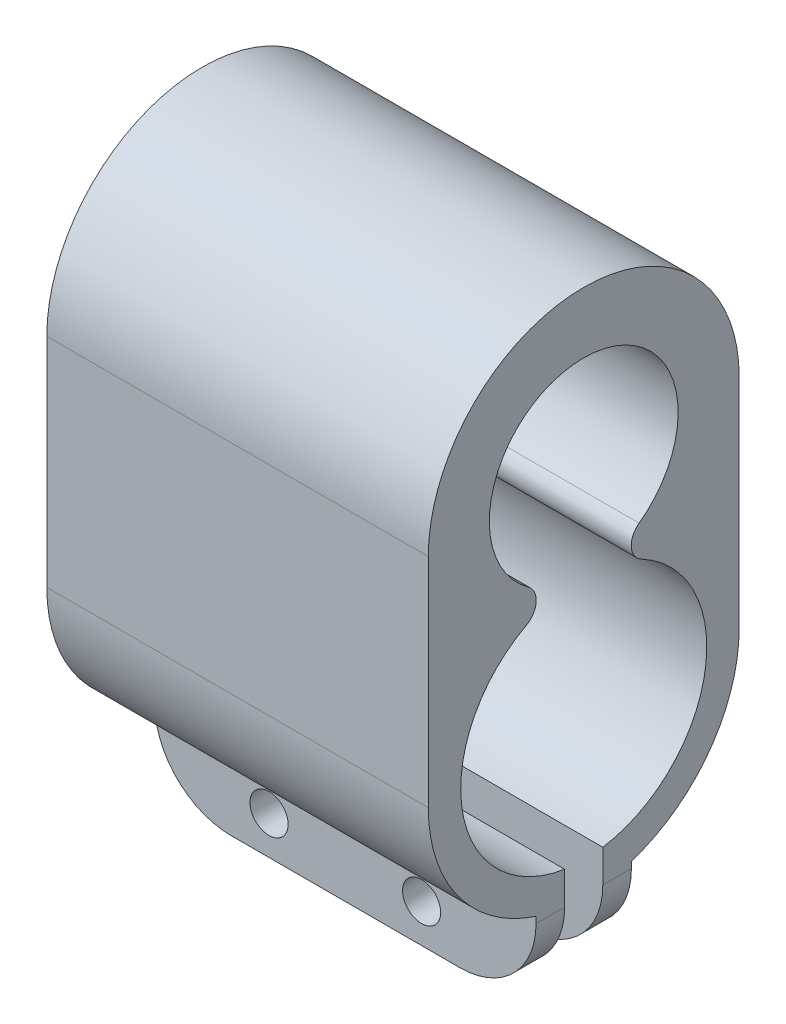
ISO-10303-21;
HEADER;
FILE_DESCRIPTION(('STEP AP214'),'2;1');
FILE_NAME('part.step','',(''),(''),'','','');
FILE_SCHEMA(('AUTOMOTIVE_DESIGN { 1 0 10303 214 1 1 1 1 }'));
ENDSEC;
DATA;
#1=APPLICATION_CONTEXT('core data for automotive mechanical design processes');
#2=APPLICATION_PROTOCOL_DEFINITION('international standard','automotive_design',2000,#1);
#3=PRODUCT_CONTEXT('',#1,'mechanical');
#4=PRODUCT('Part','Part','',(#3));
#5=PRODUCT_RELATED_PRODUCT_CATEGORY('part','',(#4));
#6=PRODUCT_DEFINITION_FORMATION('','',#4);
#7=PRODUCT_DEFINITION_CONTEXT('part definition',#1,'design');
#8=PRODUCT_DEFINITION('design','',#6,#7);
#9=PRODUCT_DEFINITION_SHAPE('','',#8);
#10=(LENGTH_UNIT() NAMED_UNIT(*) SI_UNIT(.MILLI.,.METRE.));
#11=(NAMED_UNIT(*) PLANE_ANGLE_UNIT() SI_UNIT($,.RADIAN.));
#12=(NAMED_UNIT(*) SI_UNIT($,.STERADIAN.) SOLID_ANGLE_UNIT());
#13=UNCERTAINTY_MEASURE_WITH_UNIT(LENGTH_MEASURE(1.E-05),#10,'distance_accuracy_value','');
#14=(GEOMETRIC_REPRESENTATION_CONTEXT(3) GLOBAL_UNCERTAINTY_ASSIGNED_CONTEXT((#13)) GLOBAL_UNIT_ASSIGNED_CONTEXT((#10,
#11,#12)) REPRESENTATION_CONTEXT('',''));
#15=CARTESIAN_POINT('',(0.,0.,0.));
#16=DIRECTION('',(0.,0.,1.));
#17=DIRECTION('',(1.,0.,0.));
#18=AXIS2_PLACEMENT_3D('',#15,#16,#17);
#19=CARTESIAN_POINT('',(20.,0.,0.));
#20=DIRECTION('',(-1.,0.,0.));
#21=DIRECTION('',(0.,0.,1.));
#22=AXIS2_PLACEMENT_3D('',#19,#20,#21);
#23=CYLINDRICAL_SURFACE('',#22,8.15);
#24=CARTESIAN_POINT('',(0.,0.,0.));
#25=DIRECTION('',(1.,0.,0.));
#26=DIRECTION('',(0.,0.,-1.));
#27=AXIS2_PLACEMENT_3D('',#24,#25,#26);
#28=CIRCLE('',#27,8.15);
#29=CARTESIAN_POINT('',(0.,0.,8.15));
#30=VERTEX_POINT('',#29);
#31=CARTESIAN_POINT('',(0.,-7.75709352786209,2.5));
#32=VERTEX_POINT('',#31);
#33=EDGE_CURVE('E184',#30,#32,#28,.T.);
#34=ORIENTED_EDGE('',*,*,#33,.T.);
#35=DIRECTION('',(-1.,0.,0.));
#36=VECTOR('',#35,1.);
#37=CARTESIAN_POINT('',(20.,-7.75709352786209,2.5));
#38=LINE('',#37,#36);
#39=CARTESIAN_POINT('',(20.,-7.75709352786209,2.5));
#40=VERTEX_POINT('',#39);
#41=EDGE_CURVE('E215',#32,#40,#38,.F.);
#42=ORIENTED_EDGE('',*,*,#41,.T.);
#43=CARTESIAN_POINT('',(20.,0.,0.));
#44=DIRECTION('',(1.,0.,0.));
#45=DIRECTION('',(0.,0.,-1.));
#46=AXIS2_PLACEMENT_3D('',#43,#44,#45);
#47=CIRCLE('',#46,8.15);
#48=CARTESIAN_POINT('',(20.,0.,8.15));
#49=VERTEX_POINT('',#48);
#50=EDGE_CURVE('E272',#49,#40,#47,.T.);
#51=ORIENTED_EDGE('',*,*,#50,.F.);
#52=DIRECTION('',(-1.,0.,0.));
#53=VECTOR('',#52,1.);
#54=CARTESIAN_POINT('',(20.,0.,8.15));
#55=LINE('',#54,#53);
#56=EDGE_CURVE('E287',#49,#30,#55,.T.);
#57=ORIENTED_EDGE('',*,*,#56,.T.);
#58=EDGE_LOOP('',(#34,#42,#51,#57));
#59=FACE_BOUND('',#58,.T.);
#60=ADVANCED_FACE('F33',(#59),#23,.T.);
#61=CARTESIAN_POINT('',(20.,0.,0.));
#62=DIRECTION('',(-1.,0.,0.));
#63=DIRECTION('',(0.,0.,1.));
#64=AXIS2_PLACEMENT_3D('',#61,#62,#63);
#65=CYLINDRICAL_SURFACE('',#64,6.45);
#66=DIRECTION('',(-1.,0.,0.));
#67=VECTOR('',#66,1.);
#68=CARTESIAN_POINT('',(20.,-6.37200910231616,1.));
#69=LINE('',#68,#67);
#70=CARTESIAN_POINT('',(0.,-6.37200910231616,1.));
#71=VERTEX_POINT('',#70);
#72=CARTESIAN_POINT('',(20.,-6.37200910231616,1.));
#73=VERTEX_POINT('',#72);
#74=EDGE_CURVE('E193',#71,#73,#69,.F.);
#75=ORIENTED_EDGE('',*,*,#74,.F.);
#76=CARTESIAN_POINT('',(0.,0.,0.));
#77=DIRECTION('',(1.,0.,0.));
#78=DIRECTION('',(0.,0.,-1.));
#79=AXIS2_PLACEMENT_3D('',#76,#77,#78);
#80=CIRCLE('',#79,6.45);
#81=CARTESIAN_POINT('',(0.,5.69814553161427,3.02219084449415));
#82=VERTEX_POINT('',#81);
#83=EDGE_CURVE('E236',#82,#71,#80,.T.);
#84=ORIENTED_EDGE('',*,*,#83,.F.);
#85=DIRECTION('',(-1.,0.,0.));
#86=VECTOR('',#85,1.);
#87=CARTESIAN_POINT('',(20.,5.69814553161427,3.02219084449415));
#88=LINE('',#87,#86);
#89=CARTESIAN_POINT('',(20.,5.69814553161427,3.02219084449416));
#90=VERTEX_POINT('',#89);
#91=EDGE_CURVE('E259',#90,#82,#88,.T.);
#92=ORIENTED_EDGE('',*,*,#91,.F.);
#93=CARTESIAN_POINT('',(20.,0.,0.));
#94=DIRECTION('',(1.,0.,0.));
#95=DIRECTION('',(0.,0.,-1.));
#96=AXIS2_PLACEMENT_3D('',#93,#94,#95);
#97=CIRCLE('',#96,6.45);
#98=EDGE_CURVE('E242',#90,#73,#97,.T.);
#99=ORIENTED_EDGE('',*,*,#98,.T.);
#100=EDGE_LOOP('',(#75,#84,#92,#99));
#101=FACE_BOUND('',#100,.T.);
#102=ADVANCED_FACE('F360',(#101),#65,.F.);
#103=CARTESIAN_POINT('',(20.,11.4,0.));
#104=DIRECTION('',(1.,0.,0.));
#105=DIRECTION('',(0.,0.,-1.));
#106=AXIS2_PLACEMENT_3D('',#103,#104,#105);
#107=PLANE('',#106);
#108=DIRECTION('',(0.,-1.,0.));
#109=VECTOR('',#108,1.);
#110=CARTESIAN_POINT('',(20.,-6.37200910231616,2.5));
#111=LINE('',#110,#109);
#112=CARTESIAN_POINT('',(20.,-8.08841764500326,2.5));
#113=VERTEX_POINT('',#112);
#114=EDGE_CURVE('E198',#40,#113,#111,.T.);
#115=ORIENTED_EDGE('',*,*,#114,.T.);
#116=DIRECTION('',(0.,0.,-1.));
#117=VECTOR('',#116,1.);
#118=CARTESIAN_POINT('',(20.,-8.08841764500326,0.));
#119=LINE('',#118,#117);
#120=CARTESIAN_POINT('',(20.,-8.08841764500326,1.));
#121=VERTEX_POINT('',#120);
#122=EDGE_CURVE('E11',#113,#121,#119,.T.);
#123=ORIENTED_EDGE('',*,*,#122,.T.);
#124=DIRECTION('',(0.,-1.,0.));
#125=VECTOR('',#124,1.);
#126=CARTESIAN_POINT('',(20.,-2.74249735562648,1.));
#127=LINE('',#126,#125);
#128=EDGE_CURVE('E223',#73,#121,#127,.T.);
#129=ORIENTED_EDGE('',*,*,#128,.F.);
#130=ORIENTED_EDGE('',*,*,#98,.F.);
#131=CARTESIAN_POINT('',(20.,6.58157894736842,3.49074756457077));
#132=DIRECTION('',(-1.,0.,0.));
#133=DIRECTION('',(0.,0.,-1.));
#134=AXIS2_PLACEMENT_3D('',#131,#132,#133);
#135=CIRCLE('',#134,0.999999999999998);
#136=CARTESIAN_POINT('',(20.,7.39139761167625,2.9040673016177));
#137=VERTEX_POINT('',#136);
#138=EDGE_CURVE('E238',#137,#90,#135,.T.);
#139=ORIENTED_EDGE('',*,*,#138,.F.);
#140=CARTESIAN_POINT('',(20.,11.4,0.));
#141=DIRECTION('',(1.,0.,0.));
#142=DIRECTION('',(0.,0.,-1.));
#143=AXIS2_PLACEMENT_3D('',#140,#141,#142);
#144=CIRCLE('',#143,4.95);
#145=CARTESIAN_POINT('',(20.,7.39139761167625,-2.9040673016177));
#146=VERTEX_POINT('',#145);
#147=EDGE_CURVE('E235',#146,#137,#144,.T.);
#148=ORIENTED_EDGE('',*,*,#147,.F.);
#149=CARTESIAN_POINT('',(20.,6.58157894736842,-3.49074756457077));
#150=DIRECTION('',(-1.,0.,0.));
#151=DIRECTION('',(0.,0.,-1.));
#152=AXIS2_PLACEMENT_3D('',#149,#150,#151);
#153=CIRCLE('',#152,0.999999999999999);
#154=CARTESIAN_POINT('',(20.,5.69814553161427,-3.02219084449416));
#155=VERTEX_POINT('',#154);
#156=EDGE_CURVE('E233',#155,#146,#153,.T.);
#157=ORIENTED_EDGE('',*,*,#156,.F.);
#158=CARTESIAN_POINT('',(20.,-6.37200910231616,-1.));
#159=VERTEX_POINT('',#158);
#160=EDGE_CURVE('E241',#159,#155,#97,.T.);
#161=ORIENTED_EDGE('',*,*,#160,.F.);
#162=DIRECTION('',(0.,1.,0.));
#163=VECTOR('',#162,1.);
#164=CARTESIAN_POINT('',(20.,-2.74249735562648,-1.));
#165=LINE('',#164,#163);
#166=CARTESIAN_POINT('',(20.,-8.08841764500326,-1.));
#167=VERTEX_POINT('',#166);
#168=EDGE_CURVE('E227',#167,#159,#165,.T.);
#169=ORIENTED_EDGE('',*,*,#168,.F.);
#170=DIRECTION('',(0.,0.,-1.));
#171=VECTOR('',#170,1.);
#172=CARTESIAN_POINT('',(20.,-8.08841764500326,0.));
#173=LINE('',#172,#171);
#174=CARTESIAN_POINT('',(20.,-8.08841764500326,-2.5));
#175=VERTEX_POINT('',#174);
#176=EDGE_CURVE('E41',#167,#175,#173,.T.);
#177=ORIENTED_EDGE('',*,*,#176,.T.);
#178=DIRECTION('',(0.,1.,0.));
#179=VECTOR('',#178,1.);
#180=CARTESIAN_POINT('',(20.,-6.37200910231616,-2.5));
#181=LINE('',#180,#179);
#182=CARTESIAN_POINT('',(20.,-7.75709352786209,-2.5));
#183=VERTEX_POINT('',#182);
#184=EDGE_CURVE('E210',#175,#183,#181,.T.);
#185=ORIENTED_EDGE('',*,*,#184,.T.);
#186=CARTESIAN_POINT('',(20.,0.,-8.15));
#187=VERTEX_POINT('',#186);
#188=EDGE_CURVE('E191',#183,#187,#47,.T.);
#189=ORIENTED_EDGE('',*,*,#188,.T.);
#190=DIRECTION('',(0.,1.,0.));
#191=VECTOR('',#190,1.);
#192=CARTESIAN_POINT('',(20.,11.4,-8.15));
#193=LINE('',#192,#191);
#194=CARTESIAN_POINT('',(20.,11.4,-8.15));
#195=VERTEX_POINT('',#194);
#196=EDGE_CURVE('E275',#187,#195,#193,.T.);
#197=ORIENTED_EDGE('',*,*,#196,.T.);
#198=CARTESIAN_POINT('',(20.,11.4,0.));
#199=DIRECTION('',(1.,0.,0.));
#200=DIRECTION('',(0.,0.,-1.));
#201=AXIS2_PLACEMENT_3D('',#198,#199,#200);
#202=CIRCLE('',#201,8.15);
#203=CARTESIAN_POINT('',(20.,11.4,8.15));
#204=VERTEX_POINT('',#203);
#205=EDGE_CURVE('E267',#195,#204,#202,.T.);
#206=ORIENTED_EDGE('',*,*,#205,.T.);
#207=DIRECTION('',(0.,-1.,0.));
#208=VECTOR('',#207,1.);
#209=CARTESIAN_POINT('',(20.,11.4,8.15));
#210=LINE('',#209,#208);
#211=EDGE_CURVE('E270',#204,#49,#210,.T.);
#212=ORIENTED_EDGE('',*,*,#211,.T.);
#213=ORIENTED_EDGE('',*,*,#50,.T.);
#214=EDGE_LOOP('',(#115,#123,#129,#130,#139,#148,#157,#161,#169,#177,#185,#189,#197,#206,#212,#213));
#215=FACE_BOUND('',#214,.T.);
#216=ADVANCED_FACE('F324',(#215),#107,.T.);
#217=CARTESIAN_POINT('',(0.,11.4,0.));
#218=DIRECTION('',(1.,0.,0.));
#219=DIRECTION('',(0.,0.,-1.));
#220=AXIS2_PLACEMENT_3D('',#217,#218,#219);
#221=PLANE('',#220);
#222=DIRECTION('',(0.,-1.,0.));
#223=VECTOR('',#222,1.);
#224=CARTESIAN_POINT('',(0.,-2.74249735562648,1.));
#225=LINE('',#224,#223);
#226=CARTESIAN_POINT('',(0.,-8.08841764500326,1.));
#227=VERTEX_POINT('',#226);
#228=EDGE_CURVE('E224',#71,#227,#225,.T.);
#229=ORIENTED_EDGE('',*,*,#228,.T.);
#230=DIRECTION('',(0.,0.,1.));
#231=VECTOR('',#230,1.);
#232=CARTESIAN_POINT('',(0.,-8.08841764500326,2.5));
#233=LINE('',#232,#231);
#234=CARTESIAN_POINT('',(0.,-8.08841764500326,2.5));
#235=VERTEX_POINT('',#234);
#236=EDGE_CURVE('E298',#227,#235,#233,.T.);
#237=ORIENTED_EDGE('',*,*,#236,.T.);
#238=DIRECTION('',(0.,1.,0.));
#239=VECTOR('',#238,1.);
#240=CARTESIAN_POINT('',(0.,-6.37200910231616,2.5));
#241=LINE('',#240,#239);
#242=EDGE_CURVE('E214',#235,#32,#241,.T.);
#243=ORIENTED_EDGE('',*,*,#242,.T.);
#244=ORIENTED_EDGE('',*,*,#33,.F.);
#245=DIRECTION('',(0.,-1.,0.));
#246=VECTOR('',#245,1.);
#247=CARTESIAN_POINT('',(0.,11.4,8.15));
#248=LINE('',#247,#246);
#249=CARTESIAN_POINT('',(0.,11.4,8.15));
#250=VERTEX_POINT('',#249);
#251=EDGE_CURVE('E185',#250,#30,#248,.T.);
#252=ORIENTED_EDGE('',*,*,#251,.F.);
#253=CARTESIAN_POINT('',(0.,11.4,0.));
#254=DIRECTION('',(1.,0.,0.));
#255=DIRECTION('',(0.,0.,-1.));
#256=AXIS2_PLACEMENT_3D('',#253,#254,#255);
#257=CIRCLE('',#256,8.15);
#258=CARTESIAN_POINT('',(0.,11.4,-8.15));
#259=VERTEX_POINT('',#258);
#260=EDGE_CURVE('E266',#259,#250,#257,.T.);
#261=ORIENTED_EDGE('',*,*,#260,.F.);
#262=DIRECTION('',(0.,1.,0.));
#263=VECTOR('',#262,1.);
#264=CARTESIAN_POINT('',(0.,11.4,-8.15));
#265=LINE('',#264,#263);
#266=CARTESIAN_POINT('',(0.,0.,-8.15));
#267=VERTEX_POINT('',#266);
#268=EDGE_CURVE('E180',#267,#259,#265,.T.);
#269=ORIENTED_EDGE('',*,*,#268,.F.);
#270=CARTESIAN_POINT('',(0.,-7.75709352786209,-2.5));
#271=VERTEX_POINT('',#270);
#272=EDGE_CURVE('E171',#271,#267,#28,.T.);
#273=ORIENTED_EDGE('',*,*,#272,.F.);
#274=DIRECTION('',(0.,-1.,0.));
#275=VECTOR('',#274,1.);
#276=CARTESIAN_POINT('',(0.,-6.37200910231616,-2.5));
#277=LINE('',#276,#275);
#278=CARTESIAN_POINT('',(0.,-8.08841764500326,-2.5));
#279=VERTEX_POINT('',#278);
#280=EDGE_CURVE('E177',#271,#279,#277,.T.);
#281=ORIENTED_EDGE('',*,*,#280,.T.);
#282=DIRECTION('',(0.,0.,1.));
#283=VECTOR('',#282,1.);
#284=CARTESIAN_POINT('',(0.,-8.08841764500326,-1.));
#285=LINE('',#284,#283);
#286=CARTESIAN_POINT('',(0.,-8.08841764500326,-1.));
#287=VERTEX_POINT('',#286);
#288=EDGE_CURVE('E192',#279,#287,#285,.T.);
#289=ORIENTED_EDGE('',*,*,#288,.T.);
#290=DIRECTION('',(0.,1.,0.));
#291=VECTOR('',#290,1.);
#292=CARTESIAN_POINT('',(0.,-2.74249735562648,-1.));
#293=LINE('',#292,#291);
#294=CARTESIAN_POINT('',(0.,-6.37200910231616,-1.));
#295=VERTEX_POINT('',#294);
#296=EDGE_CURVE('E226',#287,#295,#293,.T.);
#297=ORIENTED_EDGE('',*,*,#296,.T.);
#298=CARTESIAN_POINT('',(0.,5.69814553161427,-3.02219084449416));
#299=VERTEX_POINT('',#298);
#300=EDGE_CURVE('E254',#295,#299,#80,.T.);
#301=ORIENTED_EDGE('',*,*,#300,.T.);
#302=CARTESIAN_POINT('',(0.,6.58157894736842,-3.49074756457077));
#303=DIRECTION('',(-1.,0.,0.));
#304=DIRECTION('',(0.,0.,-1.));
#305=AXIS2_PLACEMENT_3D('',#302,#303,#304);
#306=CIRCLE('',#305,0.999999999999999);
#307=CARTESIAN_POINT('',(0.,7.39139761167625,-2.9040673016177));
#308=VERTEX_POINT('',#307);
#309=EDGE_CURVE('E229',#299,#308,#306,.T.);
#310=ORIENTED_EDGE('',*,*,#309,.T.);
#311=CARTESIAN_POINT('',(0.,11.4,0.));
#312=DIRECTION('',(1.,0.,0.));
#313=DIRECTION('',(0.,0.,-1.));
#314=AXIS2_PLACEMENT_3D('',#311,#312,#313);
#315=CIRCLE('',#314,4.95);
#316=CARTESIAN_POINT('',(0.,7.39139761167625,2.9040673016177));
#317=VERTEX_POINT('',#316);
#318=EDGE_CURVE('E248',#308,#317,#315,.T.);
#319=ORIENTED_EDGE('',*,*,#318,.T.);
#320=CARTESIAN_POINT('',(0.,6.58157894736842,3.49074756457077));
#321=DIRECTION('',(-1.,0.,0.));
#322=DIRECTION('',(0.,0.,-1.));
#323=AXIS2_PLACEMENT_3D('',#320,#321,#322);
#324=CIRCLE('',#323,0.999999999999998);
#325=EDGE_CURVE('E251',#317,#82,#324,.T.);
#326=ORIENTED_EDGE('',*,*,#325,.T.);
#327=ORIENTED_EDGE('',*,*,#83,.T.);
#328=EDGE_LOOP('',(#229,#237,#243,#244,#252,#261,#269,#273,#281,#289,#297,#301,#310,#319,#326,#327));
#329=FACE_BOUND('',#328,.T.);
#330=ADVANCED_FACE('F174',(#329),#221,.F.);
#331=CARTESIAN_POINT('',(20.,11.4,0.));
#332=DIRECTION('',(-1.,0.,0.));
#333=DIRECTION('',(0.,0.,1.));
#334=AXIS2_PLACEMENT_3D('',#331,#332,#333);
#335=CYLINDRICAL_SURFACE('',#334,8.15);
#336=ORIENTED_EDGE('',*,*,#260,.T.);
#337=DIRECTION('',(-1.,0.,0.));
#338=VECTOR('',#337,1.);
#339=CARTESIAN_POINT('',(20.,11.4,8.15));
#340=LINE('',#339,#338);
#341=EDGE_CURVE('E290',#204,#250,#340,.T.);
#342=ORIENTED_EDGE('',*,*,#341,.F.);
#343=ORIENTED_EDGE('',*,*,#205,.F.);
#344=DIRECTION('',(-1.,0.,0.));
#345=VECTOR('',#344,1.);
#346=CARTESIAN_POINT('',(20.,11.4,-8.15));
#347=LINE('',#346,#345);
#348=EDGE_CURVE('E277',#195,#259,#347,.T.);
#349=ORIENTED_EDGE('',*,*,#348,.T.);
#350=EDGE_LOOP('',(#336,#342,#343,#349));
#351=FACE_BOUND('',#350,.T.);
#352=ADVANCED_FACE('F390',(#351),#335,.T.);
#353=CARTESIAN_POINT('',(20.,11.4,8.15));
#354=DIRECTION('',(0.,0.,-1.));
#355=DIRECTION('',(0.,1.,0.));
#356=AXIS2_PLACEMENT_3D('',#353,#354,#355);
#357=PLANE('',#356);
#358=ORIENTED_EDGE('',*,*,#251,.T.);
#359=ORIENTED_EDGE('',*,*,#56,.F.);
#360=ORIENTED_EDGE('',*,*,#211,.F.);
#361=ORIENTED_EDGE('',*,*,#341,.T.);
#362=EDGE_LOOP('',(#358,#359,#360,#361));
#363=FACE_BOUND('',#362,.T.);
#364=ADVANCED_FACE('F388',(#363),#357,.F.);
#365=ORIENTED_EDGE('',*,*,#188,.F.);
#366=DIRECTION('',(-1.,0.,0.));
#367=VECTOR('',#366,1.);
#368=CARTESIAN_POINT('',(20.,-7.75709352786209,-2.5));
#369=LINE('',#368,#367);
#370=EDGE_CURVE('E189',#183,#271,#369,.T.);
#371=ORIENTED_EDGE('',*,*,#370,.T.);
#372=ORIENTED_EDGE('',*,*,#272,.T.);
#373=DIRECTION('',(-1.,0.,0.));
#374=VECTOR('',#373,1.);
#375=CARTESIAN_POINT('',(20.,0.,-8.15));
#376=LINE('',#375,#374);
#377=EDGE_CURVE('E285',#187,#267,#376,.T.);
#378=ORIENTED_EDGE('',*,*,#377,.F.);
#379=EDGE_LOOP('',(#365,#371,#372,#378));
#380=FACE_BOUND('',#379,.T.);
#381=ADVANCED_FACE('F190',(#380),#23,.T.);
#382=CARTESIAN_POINT('',(20.,11.4,-8.15));
#383=DIRECTION('',(0.,0.,1.));
#384=DIRECTION('',(0.,-1.,0.));
#385=AXIS2_PLACEMENT_3D('',#382,#383,#384);
#386=PLANE('',#385);
#387=ORIENTED_EDGE('',*,*,#268,.T.);
#388=ORIENTED_EDGE('',*,*,#348,.F.);
#389=ORIENTED_EDGE('',*,*,#196,.F.);
#390=ORIENTED_EDGE('',*,*,#377,.T.);
#391=EDGE_LOOP('',(#387,#388,#389,#390));
#392=FACE_BOUND('',#391,.T.);
#393=ADVANCED_FACE('F394',(#392),#386,.F.);
#394=CARTESIAN_POINT('',(20.,6.58157894736842,-3.49074756457077));
#395=DIRECTION('',(-1.,0.,0.));
#396=DIRECTION('',(0.,0.,1.));
#397=AXIS2_PLACEMENT_3D('',#394,#395,#396);
#398=CYLINDRICAL_SURFACE('',#397,0.999999999999999);
#399=ORIENTED_EDGE('',*,*,#309,.F.);
#400=DIRECTION('',(-1.,0.,0.));
#401=VECTOR('',#400,1.);
#402=CARTESIAN_POINT('',(20.,5.69814553161427,-3.02219084449416));
#403=LINE('',#402,#401);
#404=EDGE_CURVE('E245',#155,#299,#403,.T.);
#405=ORIENTED_EDGE('',*,*,#404,.F.);
#406=ORIENTED_EDGE('',*,*,#156,.T.);
#407=DIRECTION('',(-1.,0.,0.));
#408=VECTOR('',#407,1.);
#409=CARTESIAN_POINT('',(20.,7.39139761167625,-2.9040673016177));
#410=LINE('',#409,#408);
#411=EDGE_CURVE('E263',#146,#308,#410,.T.);
#412=ORIENTED_EDGE('',*,*,#411,.T.);
#413=EDGE_LOOP('',(#399,#405,#406,#412));
#414=FACE_BOUND('',#413,.T.);
#415=ADVANCED_FACE('F343',(#414),#398,.T.);
#416=CARTESIAN_POINT('',(20.,11.4,0.));
#417=DIRECTION('',(-1.,0.,0.));
#418=DIRECTION('',(0.,0.,1.));
#419=AXIS2_PLACEMENT_3D('',#416,#417,#418);
#420=CYLINDRICAL_SURFACE('',#419,4.95);
#421=ORIENTED_EDGE('',*,*,#318,.F.);
#422=ORIENTED_EDGE('',*,*,#411,.F.);
#423=ORIENTED_EDGE('',*,*,#147,.T.);
#424=DIRECTION('',(-1.,0.,0.));
#425=VECTOR('',#424,1.);
#426=CARTESIAN_POINT('',(20.,7.39139761167625,2.9040673016177));
#427=LINE('',#426,#425);
#428=EDGE_CURVE('E261',#137,#317,#427,.T.);
#429=ORIENTED_EDGE('',*,*,#428,.T.);
#430=EDGE_LOOP('',(#421,#422,#423,#429));
#431=FACE_BOUND('',#430,.T.);
#432=ADVANCED_FACE('F348',(#431),#420,.F.);
#433=CARTESIAN_POINT('',(20.,6.58157894736842,3.49074756457077));
#434=DIRECTION('',(-1.,0.,0.));
#435=DIRECTION('',(0.,0.,1.));
#436=AXIS2_PLACEMENT_3D('',#433,#434,#435);
#437=CYLINDRICAL_SURFACE('',#436,0.999999999999998);
#438=ORIENTED_EDGE('',*,*,#325,.F.);
#439=ORIENTED_EDGE('',*,*,#428,.F.);
#440=ORIENTED_EDGE('',*,*,#138,.T.);
#441=ORIENTED_EDGE('',*,*,#91,.T.);
#442=EDGE_LOOP('',(#438,#439,#440,#441));
#443=FACE_BOUND('',#442,.T.);
#444=ADVANCED_FACE('F355',(#443),#437,.T.);
#445=DIRECTION('',(-1.,0.,0.));
#446=VECTOR('',#445,1.);
#447=CARTESIAN_POINT('',(20.,-6.37200910231616,-1.));
#448=LINE('',#447,#446);
#449=EDGE_CURVE('E293',#159,#295,#448,.T.);
#450=ORIENTED_EDGE('',*,*,#449,.F.);
#451=ORIENTED_EDGE('',*,*,#160,.T.);
#452=ORIENTED_EDGE('',*,*,#404,.T.);
#453=ORIENTED_EDGE('',*,*,#300,.F.);
#454=EDGE_LOOP('',(#450,#451,#452,#453));
#455=FACE_BOUND('',#454,.T.);
#456=ADVANCED_FACE('F339',(#455),#65,.F.);
#457=CARTESIAN_POINT('',(0.,-2.74249735562648,-1.));
#458=DIRECTION('',(0.,0.,-1.));
#459=DIRECTION('',(0.,1.,0.));
#460=AXIS2_PLACEMENT_3D('',#457,#458,#459);
#461=PLANE('',#460);
#462=CARTESIAN_POINT('',(6.,-10.0884176450033,-1.));
#463=DIRECTION('',(0.,0.,-1.));
#464=DIRECTION('',(0.,1.,0.));
#465=AXIS2_PLACEMENT_3D('',#462,#463,#464);
#466=CIRCLE('',#465,1.);
#467=CARTESIAN_POINT('',(6.,-9.08841764500325,-1.));
#468=VERTEX_POINT('',#467);
#469=EDGE_CURVE('E643',#468,#468,#466,.T.);
#470=ORIENTED_EDGE('',*,*,#469,.T.);
#471=EDGE_LOOP('',(#470));
#472=FACE_BOUND('',#471,.T.);
#473=CARTESIAN_POINT('',(14.,-10.0884176450033,-1.));
#474=DIRECTION('',(0.,0.,-1.));
#475=DIRECTION('',(0.,1.,0.));
#476=AXIS2_PLACEMENT_3D('',#473,#474,#475);
#477=CIRCLE('',#476,1.);
#478=CARTESIAN_POINT('',(14.,-9.08841764500325,-1.));
#479=VERTEX_POINT('',#478);
#480=EDGE_CURVE('E208',#479,#479,#477,.T.);
#481=ORIENTED_EDGE('',*,*,#480,.T.);
#482=EDGE_LOOP('',(#481));
#483=FACE_BOUND('',#482,.T.);
#484=ORIENTED_EDGE('',*,*,#296,.F.);
#485=CARTESIAN_POINT('',(4.,-8.08841764500326,-1.));
#486=DIRECTION('',(0.,0.,-1.));
#487=DIRECTION('',(0.,1.,0.));
#488=AXIS2_PLACEMENT_3D('',#485,#486,#487);
#489=CIRCLE('',#488,4.);
#490=CARTESIAN_POINT('',(4.,-12.0884176450033,-1.));
#491=VERTEX_POINT('',#490);
#492=EDGE_CURVE('E315',#287,#491,#489,.F.);
#493=ORIENTED_EDGE('',*,*,#492,.T.);
#494=DIRECTION('',(1.,0.,0.));
#495=VECTOR('',#494,1.);
#496=CARTESIAN_POINT('',(-5.90993457044205,-12.0884176450033,-1.));
#497=LINE('',#496,#495);
#498=CARTESIAN_POINT('',(16.,-12.0884176450033,-1.));
#499=VERTEX_POINT('',#498);
#500=EDGE_CURVE('E204',#491,#499,#497,.T.);
#501=ORIENTED_EDGE('',*,*,#500,.T.);
#502=CARTESIAN_POINT('',(16.,-8.08841764500326,-1.));
#503=DIRECTION('',(0.,0.,-1.));
#504=DIRECTION('',(0.,1.,0.));
#505=AXIS2_PLACEMENT_3D('',#502,#503,#504);
#506=CIRCLE('',#505,4.);
#507=EDGE_CURVE('E313',#499,#167,#506,.F.);
#508=ORIENTED_EDGE('',*,*,#507,.T.);
#509=ORIENTED_EDGE('',*,*,#168,.T.);
#510=ORIENTED_EDGE('',*,*,#449,.T.);
#511=EDGE_LOOP('',(#484,#493,#501,#508,#509,#510));
#512=FACE_BOUND('',#511,.T.);
#513=ADVANCED_FACE('F329',(#472,#483,#512),#461,.F.);
#514=CARTESIAN_POINT('',(0.,-2.74249735562648,1.));
#515=DIRECTION('',(0.,0.,1.));
#516=DIRECTION('',(0.,-1.,0.));
#517=AXIS2_PLACEMENT_3D('',#514,#515,#516);
#518=PLANE('',#517);
#519=CARTESIAN_POINT('',(6.,-10.0884176450033,1.));
#520=DIRECTION('',(0.,0.,1.));
#521=DIRECTION('',(0.,-1.,0.));
#522=AXIS2_PLACEMENT_3D('',#519,#520,#521);
#523=CIRCLE('',#522,1.);
#524=CARTESIAN_POINT('',(6.,-11.0884176450033,1.));
#525=VERTEX_POINT('',#524);
#526=EDGE_CURVE('E646',#525,#525,#523,.T.);
#527=ORIENTED_EDGE('',*,*,#526,.T.);
#528=EDGE_LOOP('',(#527));
#529=FACE_BOUND('',#528,.T.);
#530=CARTESIAN_POINT('',(14.,-10.0884176450033,1.));
#531=DIRECTION('',(0.,0.,1.));
#532=DIRECTION('',(0.,-1.,0.));
#533=AXIS2_PLACEMENT_3D('',#530,#531,#532);
#534=CIRCLE('',#533,1.);
#535=CARTESIAN_POINT('',(14.,-11.0884176450033,1.));
#536=VERTEX_POINT('',#535);
#537=EDGE_CURVE('E634',#536,#536,#534,.T.);
#538=ORIENTED_EDGE('',*,*,#537,.T.);
#539=EDGE_LOOP('',(#538));
#540=FACE_BOUND('',#539,.T.);
#541=DIRECTION('',(1.,0.,0.));
#542=VECTOR('',#541,1.);
#543=CARTESIAN_POINT('',(-5.90993457044205,-12.0884176450033,0.999999999999999));
#544=LINE('',#543,#542);
#545=CARTESIAN_POINT('',(4.,-12.0884176450033,0.999999999999999));
#546=VERTEX_POINT('',#545);
#547=CARTESIAN_POINT('',(16.,-12.0884176450033,0.999999999999999));
#548=VERTEX_POINT('',#547);
#549=EDGE_CURVE('E216',#546,#548,#544,.T.);
#550=ORIENTED_EDGE('',*,*,#549,.F.);
#551=CARTESIAN_POINT('',(4.,-8.08841764500326,1.));
#552=DIRECTION('',(0.,0.,1.));
#553=DIRECTION('',(0.,-1.,0.));
#554=AXIS2_PLACEMENT_3D('',#551,#552,#553);
#555=CIRCLE('',#554,4.);
#556=EDGE_CURVE('E311',#546,#227,#555,.F.);
#557=ORIENTED_EDGE('',*,*,#556,.T.);
#558=ORIENTED_EDGE('',*,*,#228,.F.);
#559=ORIENTED_EDGE('',*,*,#74,.T.);
#560=ORIENTED_EDGE('',*,*,#128,.T.);
#561=CARTESIAN_POINT('',(16.,-8.08841764500326,1.));
#562=DIRECTION('',(0.,0.,1.));
#563=DIRECTION('',(0.,-1.,0.));
#564=AXIS2_PLACEMENT_3D('',#561,#562,#563);
#565=CIRCLE('',#564,4.);
#566=EDGE_CURVE('E309',#121,#548,#565,.F.);
#567=ORIENTED_EDGE('',*,*,#566,.T.);
#568=EDGE_LOOP('',(#550,#557,#558,#559,#560,#567));
#569=FACE_BOUND('',#568,.T.);
#570=ADVANCED_FACE('F363',(#529,#540,#569),#518,.F.);
#571=CARTESIAN_POINT('',(-5.90993457044205,-6.37200910231616,2.5));
#572=DIRECTION('',(0.,0.,1.));
#573=DIRECTION('',(0.,-1.,0.));
#574=AXIS2_PLACEMENT_3D('',#571,#572,#573);
#575=PLANE('',#574);
#576=CARTESIAN_POINT('',(6.,-10.0884176450033,2.5));
#577=DIRECTION('',(0.,0.,1.));
#578=DIRECTION('',(0.,-1.,0.));
#579=AXIS2_PLACEMENT_3D('',#576,#577,#578);
#580=CIRCLE('',#579,1.);
#581=CARTESIAN_POINT('',(6.,-11.0884176450033,2.5));
#582=VERTEX_POINT('',#581);
#583=EDGE_CURVE('E649',#582,#582,#580,.T.);
#584=ORIENTED_EDGE('',*,*,#583,.F.);
#585=EDGE_LOOP('',(#584));
#586=FACE_BOUND('',#585,.T.);
#587=CARTESIAN_POINT('',(14.,-10.0884176450033,2.5));
#588=DIRECTION('',(0.,0.,1.));
#589=DIRECTION('',(0.,-1.,0.));
#590=AXIS2_PLACEMENT_3D('',#587,#588,#589);
#591=CIRCLE('',#590,1.);
#592=CARTESIAN_POINT('',(14.,-11.0884176450033,2.5));
#593=VERTEX_POINT('',#592);
#594=EDGE_CURVE('E636',#593,#593,#591,.T.);
#595=ORIENTED_EDGE('',*,*,#594,.F.);
#596=EDGE_LOOP('',(#595));
#597=FACE_BOUND('',#596,.T.);
#598=ORIENTED_EDGE('',*,*,#242,.F.);
#599=CARTESIAN_POINT('',(4.,-8.08841764500326,2.5));
#600=DIRECTION('',(0.,0.,1.));
#601=DIRECTION('',(0.,-1.,0.));
#602=AXIS2_PLACEMENT_3D('',#599,#600,#601);
#603=CIRCLE('',#602,4.);
#604=CARTESIAN_POINT('',(4.,-12.0884176450033,2.5));
#605=VERTEX_POINT('',#604);
#606=EDGE_CURVE('E303',#235,#605,#603,.T.);
#607=ORIENTED_EDGE('',*,*,#606,.T.);
#608=DIRECTION('',(1.,0.,0.));
#609=VECTOR('',#608,1.);
#610=CARTESIAN_POINT('',(-5.90993457044205,-12.0884176450033,2.5));
#611=LINE('',#610,#609);
#612=CARTESIAN_POINT('',(16.,-12.0884176450033,2.5));
#613=VERTEX_POINT('',#612);
#614=EDGE_CURVE('E202',#605,#613,#611,.T.);
#615=ORIENTED_EDGE('',*,*,#614,.T.);
#616=CARTESIAN_POINT('',(16.,-8.08841764500326,2.5));
#617=DIRECTION('',(0.,0.,1.));
#618=DIRECTION('',(0.,-1.,0.));
#619=AXIS2_PLACEMENT_3D('',#616,#617,#618);
#620=CIRCLE('',#619,4.);
#621=EDGE_CURVE('E301',#613,#113,#620,.T.);
#622=ORIENTED_EDGE('',*,*,#621,.T.);
#623=ORIENTED_EDGE('',*,*,#114,.F.);
#624=ORIENTED_EDGE('',*,*,#41,.F.);
#625=EDGE_LOOP('',(#598,#607,#615,#622,#623,#624));
#626=FACE_BOUND('',#625,.T.);
#627=ADVANCED_FACE('F381',(#586,#597,#626),#575,.T.);
#628=CARTESIAN_POINT('',(-5.90993457044205,-12.0884176450033,0.999999999999999));
#629=DIRECTION('',(0.,-1.,0.));
#630=DIRECTION('',(0.,0.,-1.));
#631=AXIS2_PLACEMENT_3D('',#628,#629,#630);
#632=PLANE('',#631);
#633=ORIENTED_EDGE('',*,*,#614,.F.);
#634=DIRECTION('',(0.,0.,1.));
#635=VECTOR('',#634,1.);
#636=CARTESIAN_POINT('',(4.,-12.0884176450033,0.999999999999999));
#637=LINE('',#636,#635);
#638=EDGE_CURVE('E307',#605,#546,#637,.F.);
#639=ORIENTED_EDGE('',*,*,#638,.T.);
#640=ORIENTED_EDGE('',*,*,#549,.T.);
#641=DIRECTION('',(0.,0.,-1.));
#642=VECTOR('',#641,1.);
#643=CARTESIAN_POINT('',(16.,-12.0884176450033,0.999999999999999));
#644=LINE('',#643,#642);
#645=EDGE_CURVE('E305',#548,#613,#644,.F.);
#646=ORIENTED_EDGE('',*,*,#645,.T.);
#647=EDGE_LOOP('',(#633,#639,#640,#646));
#648=FACE_BOUND('',#647,.T.);
#649=ADVANCED_FACE('F373',(#648),#632,.T.);
#650=CARTESIAN_POINT('',(-5.90993457044205,-6.37200910231616,-2.5));
#651=DIRECTION('',(0.,0.,-1.));
#652=DIRECTION('',(0.,1.,0.));
#653=AXIS2_PLACEMENT_3D('',#650,#651,#652);
#654=PLANE('',#653);
#655=CARTESIAN_POINT('',(6.,-10.0884176450033,-2.5));
#656=DIRECTION('',(0.,0.,-1.));
#657=DIRECTION('',(0.,1.,0.));
#658=AXIS2_PLACEMENT_3D('',#655,#656,#657);
#659=CIRCLE('',#658,1.);
#660=CARTESIAN_POINT('',(6.,-9.08841764500325,-2.5));
#661=VERTEX_POINT('',#660);
#662=EDGE_CURVE('E652',#661,#661,#659,.T.);
#663=ORIENTED_EDGE('',*,*,#662,.F.);
#664=EDGE_LOOP('',(#663));
#665=FACE_BOUND('',#664,.T.);
#666=CARTESIAN_POINT('',(14.,-10.0884176450033,-2.5));
#667=DIRECTION('',(0.,0.,-1.));
#668=DIRECTION('',(0.,1.,0.));
#669=AXIS2_PLACEMENT_3D('',#666,#667,#668);
#670=CIRCLE('',#669,1.);
#671=CARTESIAN_POINT('',(14.,-9.08841764500325,-2.5));
#672=VERTEX_POINT('',#671);
#673=EDGE_CURVE('E630',#672,#672,#670,.T.);
#674=ORIENTED_EDGE('',*,*,#673,.F.);
#675=EDGE_LOOP('',(#674));
#676=FACE_BOUND('',#675,.T.);
#677=DIRECTION('',(1.,0.,0.));
#678=VECTOR('',#677,1.);
#679=CARTESIAN_POINT('',(-5.90993457044205,-12.0884176450033,-2.5));
#680=LINE('',#679,#678);
#681=CARTESIAN_POINT('',(4.,-12.0884176450033,-2.5));
#682=VERTEX_POINT('',#681);
#683=CARTESIAN_POINT('',(16.,-12.0884176450033,-2.5));
#684=VERTEX_POINT('',#683);
#685=EDGE_CURVE('E199',#682,#684,#680,.T.);
#686=ORIENTED_EDGE('',*,*,#685,.F.);
#687=CARTESIAN_POINT('',(4.,-8.08841764500326,-2.5));
#688=DIRECTION('',(0.,0.,-1.));
#689=DIRECTION('',(0.,1.,0.));
#690=AXIS2_PLACEMENT_3D('',#687,#688,#689);
#691=CIRCLE('',#690,4.);
#692=EDGE_CURVE('E197',#682,#279,#691,.T.);
#693=ORIENTED_EDGE('',*,*,#692,.T.);
#694=ORIENTED_EDGE('',*,*,#280,.F.);
#695=ORIENTED_EDGE('',*,*,#370,.F.);
#696=ORIENTED_EDGE('',*,*,#184,.F.);
#697=CARTESIAN_POINT('',(16.,-8.08841764500326,-2.5));
#698=DIRECTION('',(0.,0.,-1.));
#699=DIRECTION('',(0.,1.,0.));
#700=AXIS2_PLACEMENT_3D('',#697,#698,#699);
#701=CIRCLE('',#700,4.);
#702=EDGE_CURVE('E48',#175,#684,#701,.T.);
#703=ORIENTED_EDGE('',*,*,#702,.T.);
#704=EDGE_LOOP('',(#686,#693,#694,#695,#696,#703));
#705=FACE_BOUND('',#704,.T.);
#706=ADVANCED_FACE('F195',(#665,#676,#705),#654,.T.);
#707=CARTESIAN_POINT('',(-5.90993457044205,-12.0884176450033,-1.));
#708=DIRECTION('',(0.,-1.,0.));
#709=DIRECTION('',(0.,0.,-1.));
#710=AXIS2_PLACEMENT_3D('',#707,#708,#709);
#711=PLANE('',#710);
#712=ORIENTED_EDGE('',*,*,#500,.F.);
#713=DIRECTION('',(0.,0.,1.));
#714=VECTOR('',#713,1.);
#715=CARTESIAN_POINT('',(4.,-12.0884176450033,-2.5));
#716=LINE('',#715,#714);
#717=EDGE_CURVE('E319',#491,#682,#716,.F.);
#718=ORIENTED_EDGE('',*,*,#717,.T.);
#719=ORIENTED_EDGE('',*,*,#685,.T.);
#720=DIRECTION('',(0.,0.,-1.));
#721=VECTOR('',#720,1.);
#722=CARTESIAN_POINT('',(16.,-12.0884176450033,-1.));
#723=LINE('',#722,#721);
#724=EDGE_CURVE('E317',#684,#499,#723,.F.);
#725=ORIENTED_EDGE('',*,*,#724,.T.);
#726=EDGE_LOOP('',(#712,#718,#719,#725));
#727=FACE_BOUND('',#726,.T.);
#728=ADVANCED_FACE('F334',(#727),#711,.T.);
#729=CARTESIAN_POINT('',(14.,-10.0884176450033,8.15));
#730=DIRECTION('',(0.,0.,-1.));
#731=DIRECTION('',(0.,1.,0.));
#732=AXIS2_PLACEMENT_3D('',#729,#730,#731);
#733=CYLINDRICAL_SURFACE('',#732,1.);
#734=ORIENTED_EDGE('',*,*,#673,.T.);
#735=EDGE_LOOP('',(#734));
#736=FACE_BOUND('',#735,.T.);
#737=ORIENTED_EDGE('',*,*,#480,.F.);
#738=EDGE_LOOP('',(#737));
#739=FACE_BOUND('',#738,.T.);
#740=ADVANCED_FACE('F450',(#736,#739),#733,.F.);
#741=ORIENTED_EDGE('',*,*,#594,.T.);
#742=EDGE_LOOP('',(#741));
#743=FACE_BOUND('',#742,.T.);
#744=ORIENTED_EDGE('',*,*,#537,.F.);
#745=EDGE_LOOP('',(#744));
#746=FACE_BOUND('',#745,.T.);
#747=ADVANCED_FACE('F513',(#743,#746),#733,.F.);
#748=CARTESIAN_POINT('',(6.,-10.0884176450033,8.15));
#749=DIRECTION('',(0.,0.,-1.));
#750=DIRECTION('',(0.,1.,0.));
#751=AXIS2_PLACEMENT_3D('',#748,#749,#750);
#752=CYLINDRICAL_SURFACE('',#751,1.);
#753=ORIENTED_EDGE('',*,*,#662,.T.);
#754=EDGE_LOOP('',(#753));
#755=FACE_BOUND('',#754,.T.);
#756=ORIENTED_EDGE('',*,*,#469,.F.);
#757=EDGE_LOOP('',(#756));
#758=FACE_BOUND('',#757,.T.);
#759=ADVANCED_FACE('F503',(#755,#758),#752,.F.);
#760=ORIENTED_EDGE('',*,*,#583,.T.);
#761=EDGE_LOOP('',(#760));
#762=FACE_BOUND('',#761,.T.);
#763=ORIENTED_EDGE('',*,*,#526,.F.);
#764=EDGE_LOOP('',(#763));
#765=FACE_BOUND('',#764,.T.);
#766=ADVANCED_FACE('F416',(#762,#765),#752,.F.);
#767=CARTESIAN_POINT('',(4.,-8.08841764500326,0.));
#768=DIRECTION('',(0.,0.,-1.));
#769=DIRECTION('',(-1.,0.,0.));
#770=AXIS2_PLACEMENT_3D('',#767,#768,#769);
#771=CYLINDRICAL_SURFACE('',#770,4.);
#772=ORIENTED_EDGE('',*,*,#556,.F.);
#773=ORIENTED_EDGE('',*,*,#638,.F.);
#774=ORIENTED_EDGE('',*,*,#606,.F.);
#775=ORIENTED_EDGE('',*,*,#236,.F.);
#776=EDGE_LOOP('',(#772,#773,#774,#775));
#777=FACE_BOUND('',#776,.T.);
#778=ADVANCED_FACE('F376',(#777),#771,.T.);
#779=CARTESIAN_POINT('',(4.,-8.08841764500326,0.));
#780=DIRECTION('',(0.,0.,-1.));
#781=DIRECTION('',(-1.,0.,0.));
#782=AXIS2_PLACEMENT_3D('',#779,#780,#781);
#783=CYLINDRICAL_SURFACE('',#782,4.);
#784=ORIENTED_EDGE('',*,*,#692,.F.);
#785=ORIENTED_EDGE('',*,*,#717,.F.);
#786=ORIENTED_EDGE('',*,*,#492,.F.);
#787=ORIENTED_EDGE('',*,*,#288,.F.);
#788=EDGE_LOOP('',(#784,#785,#786,#787));
#789=FACE_BOUND('',#788,.T.);
#790=ADVANCED_FACE('F336',(#789),#783,.T.);
#791=CARTESIAN_POINT('',(16.,-8.08841764500326,0.));
#792=DIRECTION('',(0.,0.,-1.));
#793=DIRECTION('',(-1.,0.,0.));
#794=AXIS2_PLACEMENT_3D('',#791,#792,#793);
#795=CYLINDRICAL_SURFACE('',#794,4.);
#796=ORIENTED_EDGE('',*,*,#621,.F.);
#797=ORIENTED_EDGE('',*,*,#645,.F.);
#798=ORIENTED_EDGE('',*,*,#566,.F.);
#799=ORIENTED_EDGE('',*,*,#122,.F.);
#800=EDGE_LOOP('',(#796,#797,#798,#799));
#801=FACE_BOUND('',#800,.T.);
#802=ADVANCED_FACE('F368',(#801),#795,.T.);
#803=CARTESIAN_POINT('',(16.,-8.08841764500326,0.));
#804=DIRECTION('',(0.,0.,-1.));
#805=DIRECTION('',(-1.,0.,0.));
#806=AXIS2_PLACEMENT_3D('',#803,#804,#805);
#807=CYLINDRICAL_SURFACE('',#806,4.);
#808=ORIENTED_EDGE('',*,*,#507,.F.);
#809=ORIENTED_EDGE('',*,*,#724,.F.);
#810=ORIENTED_EDGE('',*,*,#702,.F.);
#811=ORIENTED_EDGE('',*,*,#176,.F.);
#812=EDGE_LOOP('',(#808,#809,#810,#811));
#813=FACE_BOUND('',#812,.T.);
#814=ADVANCED_FACE('F35',(#813),#807,.T.);
#815=CLOSED_SHELL('',(#60,#102,#216,#330,#352,#364,#381,#393,#415,#432,#444,#456,#513,#570,#627,
#649,#706,#728,#740,#747,#759,#766,#778,#790,#802,#814));
#816=MANIFOLD_SOLID_BREP('B2',#815);
#817=ADVANCED_BREP_SHAPE_REPRESENTATION('',(#18,#816),#14);
#818=SHAPE_DEFINITION_REPRESENTATION(#9,#817);
ENDSEC;
END-ISO-10303-21;
